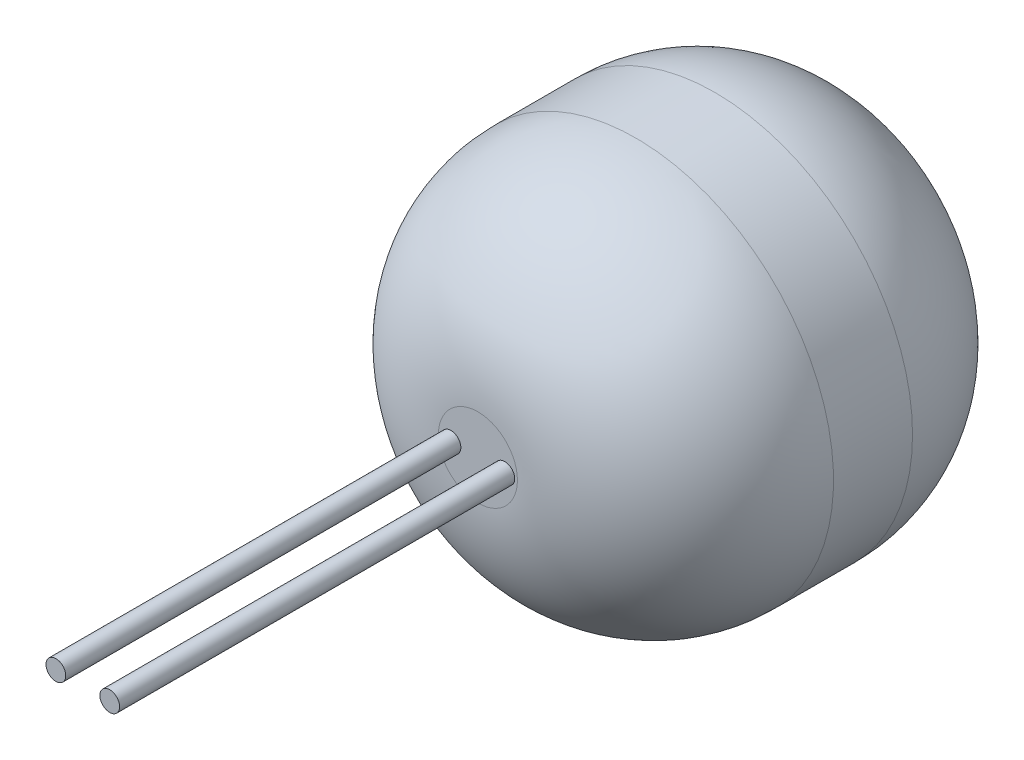
ISO-10303-21;
HEADER;
FILE_DESCRIPTION(('STEP AP214'),'2;1');
FILE_NAME('part.step','',(''),(''),'','','');
FILE_SCHEMA(('AUTOMOTIVE_DESIGN { 1 0 10303 214 1 1 1 1 }'));
ENDSEC;
DATA;
#1=APPLICATION_CONTEXT('core data for automotive mechanical design processes');
#2=APPLICATION_PROTOCOL_DEFINITION('international standard','automotive_design',2000,#1);
#3=PRODUCT_CONTEXT('',#1,'mechanical');
#4=PRODUCT('Part','Part','',(#3));
#5=PRODUCT_RELATED_PRODUCT_CATEGORY('part','',(#4));
#6=PRODUCT_DEFINITION_FORMATION('','',#4);
#7=PRODUCT_DEFINITION_CONTEXT('part definition',#1,'design');
#8=PRODUCT_DEFINITION('design','',#6,#7);
#9=PRODUCT_DEFINITION_SHAPE('','',#8);
#10=(LENGTH_UNIT() NAMED_UNIT(*) SI_UNIT(.MILLI.,.METRE.));
#11=(NAMED_UNIT(*) PLANE_ANGLE_UNIT() SI_UNIT($,.RADIAN.));
#12=(NAMED_UNIT(*) SI_UNIT($,.STERADIAN.) SOLID_ANGLE_UNIT());
#13=UNCERTAINTY_MEASURE_WITH_UNIT(LENGTH_MEASURE(1.E-05),#10,'distance_accuracy_value','');
#14=(GEOMETRIC_REPRESENTATION_CONTEXT(3) GLOBAL_UNCERTAINTY_ASSIGNED_CONTEXT((#13)) GLOBAL_UNIT_ASSIGNED_CONTEXT((#10,
#11,#12)) REPRESENTATION_CONTEXT('',''));
#15=CARTESIAN_POINT('',(0.,0.,0.));
#16=DIRECTION('',(0.,0.,1.));
#17=DIRECTION('',(1.,0.,0.));
#18=AXIS2_PLACEMENT_3D('',#15,#16,#17);
#19=CARTESIAN_POINT('',(0.136233706431234,0.,4.));
#20=DIRECTION('',(0.,0.,1.));
#21=DIRECTION('',(1.,0.,0.));
#22=AXIS2_PLACEMENT_3D('',#19,#20,#21);
#23=PLANE('',#22);
#24=CARTESIAN_POINT('',(0.136233706431234,0.,4.));
#25=DIRECTION('',(0.,0.,-1.));
#26=DIRECTION('',(-1.,0.,0.));
#27=AXIS2_PLACEMENT_3D('',#24,#25,#26);
#28=CIRCLE('',#27,0.05);
#29=CARTESIAN_POINT('',(0.0862337064312338,0.,4.));
#30=VERTEX_POINT('',#29);
#31=EDGE_CURVE('E59',#30,#30,#28,.T.);
#32=ORIENTED_EDGE('',*,*,#31,.F.);
#33=EDGE_LOOP('',(#32));
#34=FACE_BOUND('',#33,.T.);
#35=ADVANCED_FACE('F16',(#34),#23,.T.);
#36=CARTESIAN_POINT('',(-0.136275076217566,0.,4.));
#37=DIRECTION('',(0.,0.,1.));
#38=DIRECTION('',(1.,0.,0.));
#39=AXIS2_PLACEMENT_3D('',#36,#37,#38);
#40=PLANE('',#39);
#41=CARTESIAN_POINT('',(-0.136275076217566,0.,4.));
#42=DIRECTION('',(0.,0.,-1.));
#43=DIRECTION('',(-1.,0.,0.));
#44=AXIS2_PLACEMENT_3D('',#41,#42,#43);
#45=CIRCLE('',#44,0.05);
#46=CARTESIAN_POINT('',(-0.186275076217566,0.,4.));
#47=VERTEX_POINT('',#46);
#48=EDGE_CURVE('E56',#47,#47,#45,.T.);
#49=ORIENTED_EDGE('',*,*,#48,.F.);
#50=EDGE_LOOP('',(#49));
#51=FACE_BOUND('',#50,.T.);
#52=ADVANCED_FACE('F160',(#51),#40,.T.);
#53=CARTESIAN_POINT('',(0.136233706431234,0.,4.));
#54=DIRECTION('',(0.,0.,-1.));
#55=DIRECTION('',(-1.,0.,0.));
#56=AXIS2_PLACEMENT_3D('',#53,#54,#55);
#57=CYLINDRICAL_SURFACE('',#56,0.05);
#58=CARTESIAN_POINT('',(0.136233706431234,0.,2.));
#59=DIRECTION('',(0.,0.,-1.));
#60=DIRECTION('',(-1.,0.,0.));
#61=AXIS2_PLACEMENT_3D('',#58,#59,#60);
#62=CIRCLE('',#61,0.05);
#63=CARTESIAN_POINT('',(0.0862337064312338,0.,2.));
#64=VERTEX_POINT('',#63);
#65=EDGE_CURVE('E55',#64,#64,#62,.T.);
#66=ORIENTED_EDGE('',*,*,#65,.F.);
#67=EDGE_LOOP('',(#66));
#68=FACE_BOUND('',#67,.T.);
#69=ORIENTED_EDGE('',*,*,#31,.T.);
#70=EDGE_LOOP('',(#69));
#71=FACE_BOUND('',#70,.T.);
#72=ADVANCED_FACE('F157',(#68,#71),#57,.T.);
#73=CARTESIAN_POINT('',(-0.136275076217566,0.,4.));
#74=DIRECTION('',(0.,0.,-1.));
#75=DIRECTION('',(-1.,0.,0.));
#76=AXIS2_PLACEMENT_3D('',#73,#74,#75);
#77=CYLINDRICAL_SURFACE('',#76,0.05);
#78=CARTESIAN_POINT('',(-0.136275076217566,0.,2.));
#79=DIRECTION('',(0.,0.,-1.));
#80=DIRECTION('',(-1.,0.,0.));
#81=AXIS2_PLACEMENT_3D('',#78,#79,#80);
#82=CIRCLE('',#81,0.05);
#83=CARTESIAN_POINT('',(-0.186275076217566,0.,2.));
#84=VERTEX_POINT('',#83);
#85=EDGE_CURVE('E147',#84,#84,#82,.T.);
#86=ORIENTED_EDGE('',*,*,#85,.F.);
#87=EDGE_LOOP('',(#86));
#88=FACE_BOUND('',#87,.T.);
#89=ORIENTED_EDGE('',*,*,#48,.T.);
#90=EDGE_LOOP('',(#89));
#91=FACE_BOUND('',#90,.T.);
#92=ADVANCED_FACE('F124',(#88,#91),#77,.T.);
#93=CARTESIAN_POINT('',(0.,0.,2.));
#94=DIRECTION('',(0.,0.,1.));
#95=DIRECTION('',(1.,0.,0.));
#96=AXIS2_PLACEMENT_3D('',#93,#94,#95);
#97=PLANE('',#96);
#98=CARTESIAN_POINT('',(0.,0.,2.));
#99=DIRECTION('',(0.,0.,-1.));
#100=DIRECTION('',(-1.,0.,0.));
#101=AXIS2_PLACEMENT_3D('',#98,#99,#100);
#102=CIRCLE('',#101,0.2);
#103=CARTESIAN_POINT('',(0.2,0.,2.));
#104=VERTEX_POINT('',#103);
#105=CARTESIAN_POINT('',(-0.2,0.,2.));
#106=VERTEX_POINT('',#105);
#107=EDGE_CURVE('E33',#104,#106,#102,.F.);
#108=ORIENTED_EDGE('',*,*,#107,.T.);
#109=CARTESIAN_POINT('',(0.,0.,2.));
#110=DIRECTION('',(0.,0.,-1.));
#111=DIRECTION('',(1.,0.,0.));
#112=AXIS2_PLACEMENT_3D('',#109,#110,#111);
#113=CIRCLE('',#112,0.2);
#114=EDGE_CURVE('E136',#104,#106,#113,.T.);
#115=ORIENTED_EDGE('',*,*,#114,.F.);
#116=EDGE_LOOP('',(#108,#115));
#117=FACE_BOUND('',#116,.T.);
#118=ORIENTED_EDGE('',*,*,#85,.T.);
#119=EDGE_LOOP('',(#118));
#120=FACE_BOUND('',#119,.T.);
#121=ORIENTED_EDGE('',*,*,#65,.T.);
#122=EDGE_LOOP('',(#121));
#123=FACE_BOUND('',#122,.T.);
#124=ADVANCED_FACE('F115',(#117,#120,#123),#97,.T.);
#125=CARTESIAN_POINT('',(0.2,0.,1.2));
#126=DIRECTION('',(0.,1.,0.));
#127=DIRECTION('',(1.,0.,0.));
#128=AXIS2_PLACEMENT_3D('',#125,#126,#127);
#129=CIRCLE('',#128,0.8);
#130=TRIMMED_CURVE('',#129,(PARAMETER_VALUE(-1.82347658193698)),
(PARAMETER_VALUE(1.82347658193698)),.T.,.PARAMETER.);
#131=CARTESIAN_POINT('',(0.,0.,1.2));
#132=DIRECTION('',(0.,0.,1.));
#133=AXIS1_PLACEMENT('',#131,#132);
#134=SURFACE_OF_REVOLUTION('',#130,#133);
#135=ORIENTED_EDGE('',*,*,#114,.T.);
#136=ORIENTED_EDGE('',*,*,#107,.F.);
#137=EDGE_LOOP('',(#135,#136));
#138=FACE_BOUND('',#137,.T.);
#139=CARTESIAN_POINT('',(0.,0.,1.2));
#140=DIRECTION('',(0.,0.,-1.));
#141=DIRECTION('',(-1.,0.,0.));
#142=AXIS2_PLACEMENT_3D('',#139,#140,#141);
#143=CIRCLE('',#142,1.);
#144=CARTESIAN_POINT('',(-1.,0.,1.2));
#145=VERTEX_POINT('',#144);
#146=EDGE_CURVE('E50',#145,#145,#143,.T.);
#147=ORIENTED_EDGE('',*,*,#146,.F.);
#148=EDGE_LOOP('',(#147));
#149=FACE_BOUND('',#148,.T.);
#150=ADVANCED_FACE('F88',(#138,#149),#134,.F.);
#151=CARTESIAN_POINT('',(0.,0.,0.));
#152=DIRECTION('',(0.,0.,1.));
#153=DIRECTION('',(1.,0.,0.));
#154=AXIS2_PLACEMENT_3D('',#151,#152,#153);
#155=PLANE('',#154);
#156=CARTESIAN_POINT('',(0.,0.,0.));
#157=DIRECTION('',(0.,0.,1.));
#158=DIRECTION('',(1.,0.,0.));
#159=AXIS2_PLACEMENT_3D('',#156,#157,#158);
#160=CIRCLE('',#159,0.2);
#161=CARTESIAN_POINT('',(0.2,0.,0.));
#162=VERTEX_POINT('',#161);
#163=CARTESIAN_POINT('',(-0.2,0.,0.));
#164=VERTEX_POINT('',#163);
#165=EDGE_CURVE('E46',#162,#164,#160,.T.);
#166=ORIENTED_EDGE('',*,*,#165,.F.);
#167=CARTESIAN_POINT('',(0.,0.,0.));
#168=DIRECTION('',(0.,0.,1.));
#169=DIRECTION('',(-1.,0.,0.));
#170=AXIS2_PLACEMENT_3D('',#167,#168,#169);
#171=CIRCLE('',#170,0.2);
#172=EDGE_CURVE('E27',#164,#162,#171,.T.);
#173=ORIENTED_EDGE('',*,*,#172,.F.);
#174=EDGE_LOOP('',(#166,#173));
#175=FACE_BOUND('',#174,.T.);
#176=ADVANCED_FACE('F45',(#175),#155,.F.);
#177=CARTESIAN_POINT('',(0.,0.,2.));
#178=DIRECTION('',(0.,0.,-1.));
#179=DIRECTION('',(-1.,0.,0.));
#180=AXIS2_PLACEMENT_3D('',#177,#178,#179);
#181=CYLINDRICAL_SURFACE('',#180,1.);
#182=ORIENTED_EDGE('',*,*,#146,.T.);
#183=EDGE_LOOP('',(#182));
#184=FACE_BOUND('',#183,.T.);
#185=CARTESIAN_POINT('',(0.,0.,0.8));
#186=DIRECTION('',(0.,0.,1.));
#187=DIRECTION('',(1.,0.,0.));
#188=AXIS2_PLACEMENT_3D('',#185,#186,#187);
#189=CIRCLE('',#188,1.);
#190=CARTESIAN_POINT('',(1.,0.,0.8));
#191=VERTEX_POINT('',#190);
#192=EDGE_CURVE('E11',#191,#191,#189,.F.);
#193=ORIENTED_EDGE('',*,*,#192,.F.);
#194=EDGE_LOOP('',(#193));
#195=FACE_BOUND('',#194,.T.);
#196=ADVANCED_FACE('F73',(#184,#195),#181,.T.);
#197=CARTESIAN_POINT('',(0.2,0.,0.8));
#198=DIRECTION('',(0.,1.,0.));
#199=DIRECTION('',(1.,0.,0.));
#200=AXIS2_PLACEMENT_3D('',#197,#198,#199);
#201=CIRCLE('',#200,0.8);
#202=TRIMMED_CURVE('',#201,(PARAMETER_VALUE(-1.82347658193698)),
(PARAMETER_VALUE(1.82347658193698)),.T.,.PARAMETER.);
#203=CARTESIAN_POINT('',(0.,0.,0.8));
#204=DIRECTION('',(0.,0.,1.));
#205=AXIS1_PLACEMENT('',#203,#204);
#206=SURFACE_OF_REVOLUTION('',#202,#205);
#207=ORIENTED_EDGE('',*,*,#192,.T.);
#208=EDGE_LOOP('',(#207));
#209=FACE_BOUND('',#208,.T.);
#210=ORIENTED_EDGE('',*,*,#172,.T.);
#211=ORIENTED_EDGE('',*,*,#165,.T.);
#212=EDGE_LOOP('',(#210,#211));
#213=FACE_BOUND('',#212,.T.);
#214=ADVANCED_FACE('F54',(#209,#213),#206,.F.);
#215=CLOSED_SHELL('',(#35,#52,#72,#92,#124,#150,#176,#196,#214));
#216=MANIFOLD_SOLID_BREP('B1',#215);
#217=ADVANCED_BREP_SHAPE_REPRESENTATION('',(#18,#216),#14);
#218=SHAPE_DEFINITION_REPRESENTATION(#9,#217);
ENDSEC;
END-ISO-10303-21;
